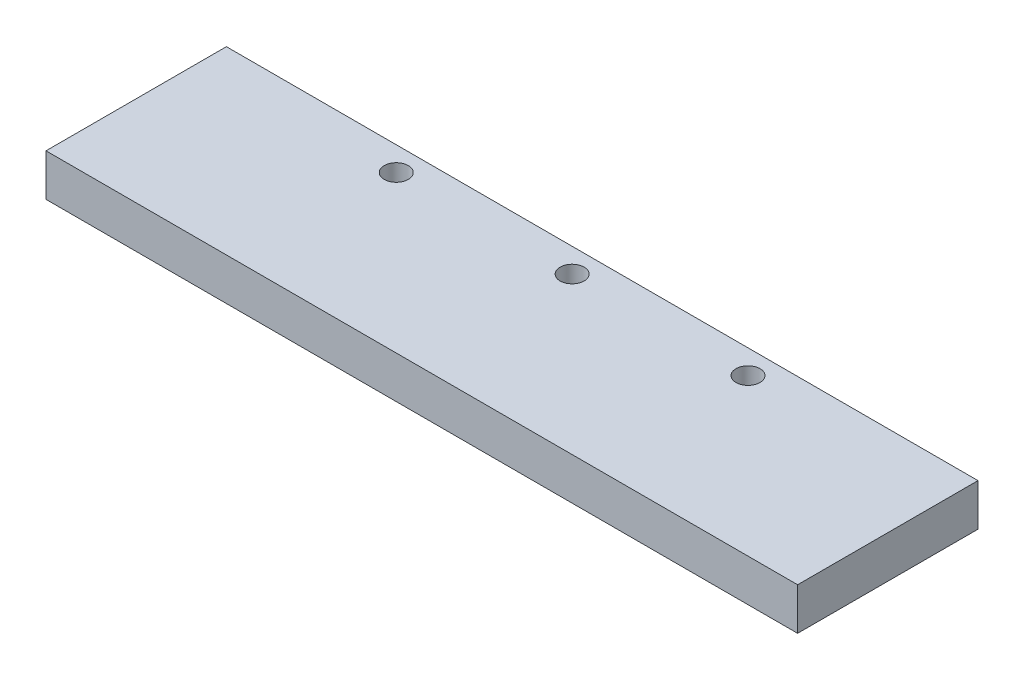
ISO-10303-21;
HEADER;
FILE_DESCRIPTION(('STEP AP214'),'2;1');
FILE_NAME('part.step','',(''),(''),'','','');
FILE_SCHEMA(('AUTOMOTIVE_DESIGN { 1 0 10303 214 1 1 1 1 }'));
ENDSEC;
DATA;
#1=APPLICATION_CONTEXT('core data for automotive mechanical design processes');
#2=APPLICATION_PROTOCOL_DEFINITION('international standard','automotive_design',2000,#1);
#3=PRODUCT_CONTEXT('',#1,'mechanical');
#4=PRODUCT('Part','Part','',(#3));
#5=PRODUCT_RELATED_PRODUCT_CATEGORY('part','',(#4));
#6=PRODUCT_DEFINITION_FORMATION('','',#4);
#7=PRODUCT_DEFINITION_CONTEXT('part definition',#1,'design');
#8=PRODUCT_DEFINITION('design','',#6,#7);
#9=PRODUCT_DEFINITION_SHAPE('','',#8);
#10=(LENGTH_UNIT() NAMED_UNIT(*) SI_UNIT(.MILLI.,.METRE.));
#11=(NAMED_UNIT(*) PLANE_ANGLE_UNIT() SI_UNIT($,.RADIAN.));
#12=(NAMED_UNIT(*) SI_UNIT($,.STERADIAN.) SOLID_ANGLE_UNIT());
#13=UNCERTAINTY_MEASURE_WITH_UNIT(LENGTH_MEASURE(1.E-05),#10,'distance_accuracy_value','');
#14=(GEOMETRIC_REPRESENTATION_CONTEXT(3) GLOBAL_UNCERTAINTY_ASSIGNED_CONTEXT((#13)) GLOBAL_UNIT_ASSIGNED_CONTEXT((#10,
#11,#12)) REPRESENTATION_CONTEXT('',''));
#15=CARTESIAN_POINT('',(0.,0.,0.));
#16=DIRECTION('',(0.,0.,1.));
#17=DIRECTION('',(1.,0.,0.));
#18=AXIS2_PLACEMENT_3D('',#15,#16,#17);
#19=CARTESIAN_POINT('',(-102.510460251046,7.,-65.1673640167364));
#20=DIRECTION('',(0.,0.,-1.));
#21=DIRECTION('',(-1.,0.,0.));
#22=AXIS2_PLACEMENT_3D('',#19,#20,#21);
#23=PLANE('',#22);
#24=DIRECTION('',(1.,0.,0.));
#25=VECTOR('',#24,1.);
#26=CARTESIAN_POINT('',(-102.510460251046,0.,-65.1673640167364));
#27=LINE('',#26,#25);
#28=CARTESIAN_POINT('',(-102.510460251046,0.,-65.1673640167364));
#29=VERTEX_POINT('',#28);
#30=CARTESIAN_POINT('',(22.4895397489539,0.,-65.1673640167364));
#31=VERTEX_POINT('',#30);
#32=EDGE_CURVE('E98',#29,#31,#27,.T.);
#33=ORIENTED_EDGE('',*,*,#32,.F.);
#34=DIRECTION('',(0.,-1.,0.));
#35=VECTOR('',#34,1.);
#36=CARTESIAN_POINT('',(-102.510460251046,7.,-65.1673640167364));
#37=LINE('',#36,#35);
#38=CARTESIAN_POINT('',(-102.510460251046,7.,-65.1673640167364));
#39=VERTEX_POINT('',#38);
#40=EDGE_CURVE('E11',#39,#29,#37,.T.);
#41=ORIENTED_EDGE('',*,*,#40,.F.);
#42=DIRECTION('',(1.,0.,0.));
#43=VECTOR('',#42,1.);
#44=CARTESIAN_POINT('',(-102.510460251046,7.,-65.1673640167364));
#45=LINE('',#44,#43);
#46=CARTESIAN_POINT('',(22.4895397489539,7.,-65.1673640167364));
#47=VERTEX_POINT('',#46);
#48=EDGE_CURVE('E92',#39,#47,#45,.T.);
#49=ORIENTED_EDGE('',*,*,#48,.T.);
#50=DIRECTION('',(0.,-1.,0.));
#51=VECTOR('',#50,1.);
#52=CARTESIAN_POINT('',(22.4895397489539,7.,-65.1673640167364));
#53=LINE('',#52,#51);
#54=EDGE_CURVE('E35',#47,#31,#53,.T.);
#55=ORIENTED_EDGE('',*,*,#54,.T.);
#56=EDGE_LOOP('',(#33,#41,#49,#55));
#57=FACE_BOUND('',#56,.T.);
#58=ADVANCED_FACE('F32',(#57),#23,.T.);
#59=CARTESIAN_POINT('',(-102.510460251046,7.,-65.1673640167364));
#60=DIRECTION('',(1.,0.,0.));
#61=DIRECTION('',(0.,0.,-1.));
#62=AXIS2_PLACEMENT_3D('',#59,#60,#61);
#63=PLANE('',#62);
#64=DIRECTION('',(0.,0.,1.));
#65=VECTOR('',#64,1.);
#66=CARTESIAN_POINT('',(-102.510460251046,0.,-65.1673640167364));
#67=LINE('',#66,#65);
#68=CARTESIAN_POINT('',(-102.510460251046,0.,-35.1673640167364));
#69=VERTEX_POINT('',#68);
#70=EDGE_CURVE('E65',#29,#69,#67,.T.);
#71=ORIENTED_EDGE('',*,*,#70,.T.);
#72=DIRECTION('',(0.,-1.,0.));
#73=VECTOR('',#72,1.);
#74=CARTESIAN_POINT('',(-102.510460251046,7.,-35.1673640167364));
#75=LINE('',#74,#73);
#76=CARTESIAN_POINT('',(-102.510460251046,7.,-35.1673640167364));
#77=VERTEX_POINT('',#76);
#78=EDGE_CURVE('E41',#77,#69,#75,.T.);
#79=ORIENTED_EDGE('',*,*,#78,.F.);
#80=DIRECTION('',(0.,0.,1.));
#81=VECTOR('',#80,1.);
#82=CARTESIAN_POINT('',(-102.510460251046,7.,-65.1673640167364));
#83=LINE('',#82,#81);
#84=EDGE_CURVE('E82',#39,#77,#83,.T.);
#85=ORIENTED_EDGE('',*,*,#84,.F.);
#86=ORIENTED_EDGE('',*,*,#40,.T.);
#87=EDGE_LOOP('',(#71,#79,#85,#86));
#88=FACE_BOUND('',#87,.T.);
#89=ADVANCED_FACE('F109',(#88),#63,.F.);
#90=CARTESIAN_POINT('',(-102.510460251046,7.,-35.1673640167364));
#91=DIRECTION('',(0.,0.,-1.));
#92=DIRECTION('',(-1.,0.,0.));
#93=AXIS2_PLACEMENT_3D('',#90,#91,#92);
#94=PLANE('',#93);
#95=DIRECTION('',(1.,0.,0.));
#96=VECTOR('',#95,1.);
#97=CARTESIAN_POINT('',(-102.510460251046,0.,-35.1673640167364));
#98=LINE('',#97,#96);
#99=CARTESIAN_POINT('',(22.4895397489539,0.,-35.1673640167364));
#100=VERTEX_POINT('',#99);
#101=EDGE_CURVE('E89',#69,#100,#98,.T.);
#102=ORIENTED_EDGE('',*,*,#101,.T.);
#103=DIRECTION('',(0.,-1.,0.));
#104=VECTOR('',#103,1.);
#105=CARTESIAN_POINT('',(22.4895397489539,7.,-35.1673640167364));
#106=LINE('',#105,#104);
#107=CARTESIAN_POINT('',(22.4895397489539,7.,-35.1673640167364));
#108=VERTEX_POINT('',#107);
#109=EDGE_CURVE('E86',#108,#100,#106,.T.);
#110=ORIENTED_EDGE('',*,*,#109,.F.);
#111=DIRECTION('',(1.,0.,0.));
#112=VECTOR('',#111,1.);
#113=CARTESIAN_POINT('',(-102.510460251046,7.,-35.1673640167364));
#114=LINE('',#113,#112);
#115=EDGE_CURVE('E77',#77,#108,#114,.T.);
#116=ORIENTED_EDGE('',*,*,#115,.F.);
#117=ORIENTED_EDGE('',*,*,#78,.T.);
#118=EDGE_LOOP('',(#102,#110,#116,#117));
#119=FACE_BOUND('',#118,.T.);
#120=ADVANCED_FACE('F87',(#119),#94,.F.);
#121=CARTESIAN_POINT('',(22.4895397489539,7.,-65.1673640167364));
#122=DIRECTION('',(1.,0.,0.));
#123=DIRECTION('',(0.,0.,-1.));
#124=AXIS2_PLACEMENT_3D('',#121,#122,#123);
#125=PLANE('',#124);
#126=DIRECTION('',(0.,0.,1.));
#127=VECTOR('',#126,1.);
#128=CARTESIAN_POINT('',(22.4895397489539,0.,-65.1673640167364));
#129=LINE('',#128,#127);
#130=EDGE_CURVE('E101',#31,#100,#129,.T.);
#131=ORIENTED_EDGE('',*,*,#130,.F.);
#132=ORIENTED_EDGE('',*,*,#54,.F.);
#133=DIRECTION('',(0.,0.,1.));
#134=VECTOR('',#133,1.);
#135=CARTESIAN_POINT('',(22.4895397489539,7.,-65.1673640167364));
#136=LINE('',#135,#134);
#137=EDGE_CURVE('E81',#47,#108,#136,.T.);
#138=ORIENTED_EDGE('',*,*,#137,.T.);
#139=ORIENTED_EDGE('',*,*,#109,.T.);
#140=EDGE_LOOP('',(#131,#132,#138,#139));
#141=FACE_BOUND('',#140,.T.);
#142=ADVANCED_FACE('F91',(#141),#125,.T.);
#143=CARTESIAN_POINT('',(0.,7.,0.));
#144=DIRECTION('',(0.,-1.,0.));
#145=DIRECTION('',(0.,0.,-1.));
#146=AXIS2_PLACEMENT_3D('',#143,#144,#145);
#147=PLANE('',#146);
#148=CARTESIAN_POINT('',(-70.2604602510461,7.,-61.1673640167364));
#149=DIRECTION('',(0.,-1.,0.));
#150=DIRECTION('',(0.,0.,-1.));
#151=AXIS2_PLACEMENT_3D('',#148,#149,#150);
#152=CIRCLE('',#151,2.);
#153=CARTESIAN_POINT('',(-70.2604602510461,7.,-63.1673640167364));
#154=VERTEX_POINT('',#153);
#155=EDGE_CURVE('E102',#154,#154,#152,.T.);
#156=ORIENTED_EDGE('',*,*,#155,.T.);
#157=EDGE_LOOP('',(#156));
#158=FACE_BOUND('',#157,.T.);
#159=CARTESIAN_POINT('',(-41.0104602510461,7.,-61.1673640167364));
#160=DIRECTION('',(0.,-1.,0.));
#161=DIRECTION('',(0.,0.,-1.));
#162=AXIS2_PLACEMENT_3D('',#159,#160,#161);
#163=CIRCLE('',#162,2.);
#164=CARTESIAN_POINT('',(-41.0104602510461,7.,-63.1673640167364));
#165=VERTEX_POINT('',#164);
#166=EDGE_CURVE('E150',#165,#165,#163,.T.);
#167=ORIENTED_EDGE('',*,*,#166,.T.);
#168=EDGE_LOOP('',(#167));
#169=FACE_BOUND('',#168,.T.);
#170=CARTESIAN_POINT('',(-11.7604602510461,7.,-61.1673640167364));
#171=DIRECTION('',(0.,-1.,0.));
#172=DIRECTION('',(0.,0.,-1.));
#173=AXIS2_PLACEMENT_3D('',#170,#171,#172);
#174=CIRCLE('',#173,2.00000000000001);
#175=CARTESIAN_POINT('',(-11.7604602510461,7.,-63.1673640167364));
#176=VERTEX_POINT('',#175);
#177=EDGE_CURVE('E152',#176,#176,#174,.T.);
#178=ORIENTED_EDGE('',*,*,#177,.T.);
#179=EDGE_LOOP('',(#178));
#180=FACE_BOUND('',#179,.T.);
#181=ORIENTED_EDGE('',*,*,#48,.F.);
#182=ORIENTED_EDGE('',*,*,#84,.T.);
#183=ORIENTED_EDGE('',*,*,#115,.T.);
#184=ORIENTED_EDGE('',*,*,#137,.F.);
#185=EDGE_LOOP('',(#181,#182,#183,#184));
#186=FACE_BOUND('',#185,.T.);
#187=ADVANCED_FACE('F80',(#158,#169,#180,#186),#147,.F.);
#188=CARTESIAN_POINT('',(0.,0.,0.));
#189=DIRECTION('',(0.,-1.,0.));
#190=DIRECTION('',(0.,0.,-1.));
#191=AXIS2_PLACEMENT_3D('',#188,#189,#190);
#192=PLANE('',#191);
#193=CARTESIAN_POINT('',(-70.2604602510461,0.,-61.1673640167364));
#194=DIRECTION('',(0.,-1.,0.));
#195=DIRECTION('',(0.,0.,-1.));
#196=AXIS2_PLACEMENT_3D('',#193,#194,#195);
#197=CIRCLE('',#196,2.);
#198=CARTESIAN_POINT('',(-70.2604602510461,0.,-63.1673640167364));
#199=VERTEX_POINT('',#198);
#200=EDGE_CURVE('E148',#199,#199,#197,.T.);
#201=ORIENTED_EDGE('',*,*,#200,.F.);
#202=EDGE_LOOP('',(#201));
#203=FACE_BOUND('',#202,.T.);
#204=CARTESIAN_POINT('',(-41.0104602510461,0.,-61.1673640167364));
#205=DIRECTION('',(0.,-1.,0.));
#206=DIRECTION('',(0.,0.,-1.));
#207=AXIS2_PLACEMENT_3D('',#204,#205,#206);
#208=CIRCLE('',#207,2.);
#209=CARTESIAN_POINT('',(-41.0104602510461,0.,-63.1673640167364));
#210=VERTEX_POINT('',#209);
#211=EDGE_CURVE('E160',#210,#210,#208,.T.);
#212=ORIENTED_EDGE('',*,*,#211,.F.);
#213=EDGE_LOOP('',(#212));
#214=FACE_BOUND('',#213,.T.);
#215=CARTESIAN_POINT('',(-11.7604602510461,0.,-61.1673640167364));
#216=DIRECTION('',(0.,-1.,0.));
#217=DIRECTION('',(0.,0.,-1.));
#218=AXIS2_PLACEMENT_3D('',#215,#216,#217);
#219=CIRCLE('',#218,2.00000000000001);
#220=CARTESIAN_POINT('',(-11.7604602510461,0.,-63.1673640167364));
#221=VERTEX_POINT('',#220);
#222=EDGE_CURVE('E157',#221,#221,#219,.T.);
#223=ORIENTED_EDGE('',*,*,#222,.F.);
#224=EDGE_LOOP('',(#223));
#225=FACE_BOUND('',#224,.T.);
#226=ORIENTED_EDGE('',*,*,#32,.T.);
#227=ORIENTED_EDGE('',*,*,#130,.T.);
#228=ORIENTED_EDGE('',*,*,#101,.F.);
#229=ORIENTED_EDGE('',*,*,#70,.F.);
#230=EDGE_LOOP('',(#226,#227,#228,#229));
#231=FACE_BOUND('',#230,.T.);
#232=ADVANCED_FACE('F107',(#203,#214,#225,#231),#192,.T.);
#233=CARTESIAN_POINT('',(-11.7604602510461,10.,-61.1673640167364));
#234=DIRECTION('',(0.,-1.,0.));
#235=DIRECTION('',(0.,0.,-1.));
#236=AXIS2_PLACEMENT_3D('',#233,#234,#235);
#237=CYLINDRICAL_SURFACE('',#236,2.00000000000001);
#238=ORIENTED_EDGE('',*,*,#222,.T.);
#239=EDGE_LOOP('',(#238));
#240=FACE_BOUND('',#239,.T.);
#241=ORIENTED_EDGE('',*,*,#177,.F.);
#242=EDGE_LOOP('',(#241));
#243=FACE_BOUND('',#242,.T.);
#244=ADVANCED_FACE('F128',(#240,#243),#237,.F.);
#245=CARTESIAN_POINT('',(-41.0104602510461,10.,-61.1673640167364));
#246=DIRECTION('',(0.,-1.,0.));
#247=DIRECTION('',(0.,0.,-1.));
#248=AXIS2_PLACEMENT_3D('',#245,#246,#247);
#249=CYLINDRICAL_SURFACE('',#248,2.);
#250=ORIENTED_EDGE('',*,*,#211,.T.);
#251=EDGE_LOOP('',(#250));
#252=FACE_BOUND('',#251,.T.);
#253=ORIENTED_EDGE('',*,*,#166,.F.);
#254=EDGE_LOOP('',(#253));
#255=FACE_BOUND('',#254,.T.);
#256=ADVANCED_FACE('F135',(#252,#255),#249,.F.);
#257=CARTESIAN_POINT('',(-70.2604602510461,10.,-61.1673640167364));
#258=DIRECTION('',(0.,-1.,0.));
#259=DIRECTION('',(0.,0.,-1.));
#260=AXIS2_PLACEMENT_3D('',#257,#258,#259);
#261=CYLINDRICAL_SURFACE('',#260,2.);
#262=ORIENTED_EDGE('',*,*,#200,.T.);
#263=EDGE_LOOP('',(#262));
#264=FACE_BOUND('',#263,.T.);
#265=ORIENTED_EDGE('',*,*,#155,.F.);
#266=EDGE_LOOP('',(#265));
#267=FACE_BOUND('',#266,.T.);
#268=ADVANCED_FACE('F139',(#264,#267),#261,.F.);
#269=CLOSED_SHELL('',(#58,#89,#120,#142,#187,#232,#244,#256,#268));
#270=MANIFOLD_SOLID_BREP('B2',#269);
#271=ADVANCED_BREP_SHAPE_REPRESENTATION('',(#18,#270),#14);
#272=SHAPE_DEFINITION_REPRESENTATION(#9,#271);
ENDSEC;
END-ISO-10303-21;
